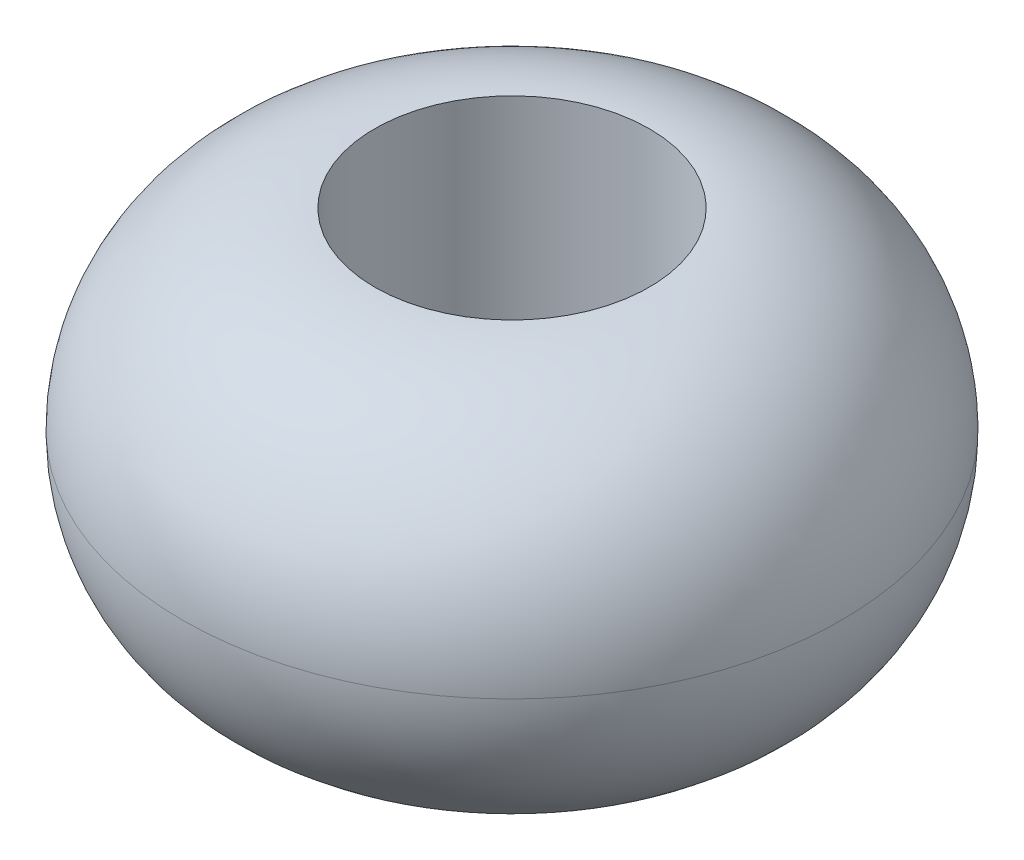
ISO-10303-21;
HEADER;
FILE_DESCRIPTION(('STEP AP214'),'2;1');
FILE_NAME('part.step','',(''),(''),'','','');
FILE_SCHEMA(('AUTOMOTIVE_DESIGN { 1 0 10303 214 1 1 1 1 }'));
ENDSEC;
DATA;
#1=APPLICATION_CONTEXT('core data for automotive mechanical design processes');
#2=APPLICATION_PROTOCOL_DEFINITION('international standard','automotive_design',2000,#1);
#3=PRODUCT_CONTEXT('',#1,'mechanical');
#4=PRODUCT('Part','Part','',(#3));
#5=PRODUCT_RELATED_PRODUCT_CATEGORY('part','',(#4));
#6=PRODUCT_DEFINITION_FORMATION('','',#4);
#7=PRODUCT_DEFINITION_CONTEXT('part definition',#1,'design');
#8=PRODUCT_DEFINITION('design','',#6,#7);
#9=PRODUCT_DEFINITION_SHAPE('','',#8);
#10=(LENGTH_UNIT() NAMED_UNIT(*) SI_UNIT(.MILLI.,.METRE.));
#11=(NAMED_UNIT(*) PLANE_ANGLE_UNIT() SI_UNIT($,.RADIAN.));
#12=(NAMED_UNIT(*) SI_UNIT($,.STERADIAN.) SOLID_ANGLE_UNIT());
#13=UNCERTAINTY_MEASURE_WITH_UNIT(LENGTH_MEASURE(1.E-05),#10,'distance_accuracy_value','');
#14=(GEOMETRIC_REPRESENTATION_CONTEXT(3) GLOBAL_UNCERTAINTY_ASSIGNED_CONTEXT((#13)) GLOBAL_UNIT_ASSIGNED_CONTEXT((#10,
#11,#12)) REPRESENTATION_CONTEXT('',''));
#15=CARTESIAN_POINT('',(0.,0.,0.));
#16=DIRECTION('',(0.,0.,1.));
#17=DIRECTION('',(1.,0.,0.));
#18=AXIS2_PLACEMENT_3D('',#15,#16,#17);
#19=CARTESIAN_POINT('',(0.,0.,0.));
#20=DIRECTION('',(0.,1.,0.));
#21=DIRECTION('',(0.,0.,1.));
#22=AXIS2_PLACEMENT_3D('',#19,#20,#21);
#23=CYLINDRICAL_SURFACE('',#22,25.);
#24=CARTESIAN_POINT('',(0.,0.,0.));
#25=DIRECTION('',(0.,1.,0.));
#26=DIRECTION('',(0.,0.,1.));
#27=AXIS2_PLACEMENT_3D('',#24,#25,#26);
#28=CIRCLE('',#27,25.);
#29=CARTESIAN_POINT('',(0.,0.,25.));
#30=VERTEX_POINT('',#29);
#31=EDGE_CURVE('E10',#30,#30,#28,.T.);
#32=ORIENTED_EDGE('',*,*,#31,.F.);
#33=EDGE_LOOP('',(#32));
#34=FACE_BOUND('',#33,.T.);
#35=CARTESIAN_POINT('',(0.,70.,0.));
#36=DIRECTION('',(0.,1.,0.));
#37=DIRECTION('',(0.,0.,1.));
#38=AXIS2_PLACEMENT_3D('',#35,#36,#37);
#39=CIRCLE('',#38,25.);
#40=CARTESIAN_POINT('',(0.,70.,25.));
#41=VERTEX_POINT('',#40);
#42=EDGE_CURVE('E45',#41,#41,#39,.T.);
#43=ORIENTED_EDGE('',*,*,#42,.T.);
#44=EDGE_LOOP('',(#43));
#45=FACE_BOUND('',#44,.T.);
#46=ADVANCED_FACE('F36',(#34,#45),#23,.F.);
#47=CARTESIAN_POINT('',(0.,35.,0.));
#48=DIRECTION('',(0.,1.,0.));
#49=DIRECTION('',(0.,0.,1.));
#50=AXIS2_PLACEMENT_3D('',#47,#48,#49);
#51=DEGENERATE_TOROIDAL_SURFACE('',#50,25.,35.,.T.);
#52=ORIENTED_EDGE('',*,*,#42,.F.);
#53=EDGE_LOOP('',(#52));
#54=FACE_BOUND('',#53,.T.);
#55=CARTESIAN_POINT('',(0.,35.,0.));
#56=DIRECTION('',(0.,1.,0.));
#57=DIRECTION('',(0.,0.,1.));
#58=AXIS2_PLACEMENT_3D('',#55,#56,#57);
#59=CIRCLE('',#58,60.);
#60=CARTESIAN_POINT('',(0.,35.,60.));
#61=VERTEX_POINT('',#60);
#62=EDGE_CURVE('E40',#61,#61,#59,.F.);
#63=ORIENTED_EDGE('',*,*,#62,.F.);
#64=EDGE_LOOP('',(#63));
#65=FACE_BOUND('',#64,.T.);
#66=ADVANCED_FACE('F38',(#54,#65),#51,.T.);
#67=CARTESIAN_POINT('',(0.,35.,0.));
#68=DIRECTION('',(0.,1.,0.));
#69=DIRECTION('',(0.,0.,1.));
#70=AXIS2_PLACEMENT_3D('',#67,#68,#69);
#71=DEGENERATE_TOROIDAL_SURFACE('',#70,25.,35.,.T.);
#72=ORIENTED_EDGE('',*,*,#31,.T.);
#73=EDGE_LOOP('',(#72));
#74=FACE_BOUND('',#73,.T.);
#75=ORIENTED_EDGE('',*,*,#62,.T.);
#76=EDGE_LOOP('',(#75));
#77=FACE_BOUND('',#76,.T.);
#78=ADVANCED_FACE('F60',(#74,#77),#71,.T.);
#79=CLOSED_SHELL('',(#46,#66,#78));
#80=MANIFOLD_SOLID_BREP('B2',#79);
#81=ADVANCED_BREP_SHAPE_REPRESENTATION('',(#18,#80),#14);
#82=SHAPE_DEFINITION_REPRESENTATION(#9,#81);
ENDSEC;
END-ISO-10303-21;
